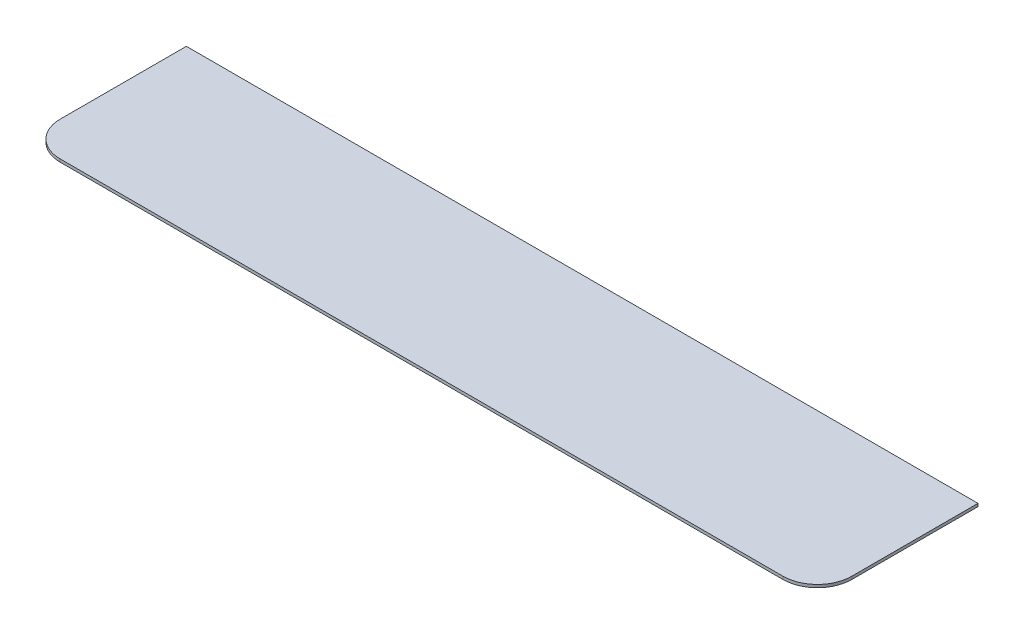
ISO-10303-21;
HEADER;
FILE_DESCRIPTION(('STEP AP214'),'2;1');
FILE_NAME('part.step','',(''),(''),'','','');
FILE_SCHEMA(('AUTOMOTIVE_DESIGN { 1 0 10303 214 1 1 1 1 }'));
ENDSEC;
DATA;
#1=APPLICATION_CONTEXT('core data for automotive mechanical design processes');
#2=APPLICATION_PROTOCOL_DEFINITION('international standard','automotive_design',2000,#1);
#3=PRODUCT_CONTEXT('',#1,'mechanical');
#4=PRODUCT('Part','Part','',(#3));
#5=PRODUCT_RELATED_PRODUCT_CATEGORY('part','',(#4));
#6=PRODUCT_DEFINITION_FORMATION('','',#4);
#7=PRODUCT_DEFINITION_CONTEXT('part definition',#1,'design');
#8=PRODUCT_DEFINITION('design','',#6,#7);
#9=PRODUCT_DEFINITION_SHAPE('','',#8);
#10=(LENGTH_UNIT() NAMED_UNIT(*) SI_UNIT(.MILLI.,.METRE.));
#11=(NAMED_UNIT(*) PLANE_ANGLE_UNIT() SI_UNIT($,.RADIAN.));
#12=(NAMED_UNIT(*) SI_UNIT($,.STERADIAN.) SOLID_ANGLE_UNIT());
#13=UNCERTAINTY_MEASURE_WITH_UNIT(LENGTH_MEASURE(1.E-05),#10,'distance_accuracy_value','');
#14=(GEOMETRIC_REPRESENTATION_CONTEXT(3) GLOBAL_UNCERTAINTY_ASSIGNED_CONTEXT((#13)) GLOBAL_UNIT_ASSIGNED_CONTEXT((#10,
#11,#12)) REPRESENTATION_CONTEXT('',''));
#15=CARTESIAN_POINT('',(0.,0.,0.));
#16=DIRECTION('',(0.,0.,1.));
#17=DIRECTION('',(1.,0.,0.));
#18=AXIS2_PLACEMENT_3D('',#15,#16,#17);
#19=CARTESIAN_POINT('',(0.,6.35,0.));
#20=DIRECTION('',(0.,1.,0.));
#21=DIRECTION('',(0.,0.,1.));
#22=AXIS2_PLACEMENT_3D('',#19,#20,#21);
#23=PLANE('',#22);
#24=DIRECTION('',(0.,0.,1.));
#25=VECTOR('',#24,1.);
#26=CARTESIAN_POINT('',(-1003.3,6.35,-177.8));
#27=LINE('',#26,#25);
#28=CARTESIAN_POINT('',(-1003.3,6.35,101.6));
#29=VERTEX_POINT('',#28);
#30=CARTESIAN_POINT('',(-1003.3,6.35,-177.8));
#31=VERTEX_POINT('',#30);
#32=EDGE_CURVE('E79',#29,#31,#27,.F.);
#33=ORIENTED_EDGE('',*,*,#32,.F.);
#34=CARTESIAN_POINT('',(-927.1,6.34999999999999,101.6));
#35=DIRECTION('',(0.,-1.,0.));
#36=DIRECTION('',(0.,0.,-1.));
#37=AXIS2_PLACEMENT_3D('',#34,#35,#36);
#38=CIRCLE('',#37,76.2);
#39=CARTESIAN_POINT('',(-927.1,6.35,177.8));
#40=VERTEX_POINT('',#39);
#41=EDGE_CURVE('E19',#40,#29,#38,.T.);
#42=ORIENTED_EDGE('',*,*,#41,.F.);
#43=DIRECTION('',(1.,0.,0.));
#44=VECTOR('',#43,1.);
#45=CARTESIAN_POINT('',(-1003.3,6.35,177.8));
#46=LINE('',#45,#44);
#47=CARTESIAN_POINT('',(673.1,6.35,177.8));
#48=VERTEX_POINT('',#47);
#49=EDGE_CURVE('E65',#48,#40,#46,.F.);
#50=ORIENTED_EDGE('',*,*,#49,.F.);
#51=CARTESIAN_POINT('',(673.1,6.34999999999999,101.6));
#52=DIRECTION('',(0.,-1.,0.));
#53=DIRECTION('',(0.,0.,-1.));
#54=AXIS2_PLACEMENT_3D('',#51,#52,#53);
#55=CIRCLE('',#54,76.2);
#56=CARTESIAN_POINT('',(749.3,6.35,101.6));
#57=VERTEX_POINT('',#56);
#58=EDGE_CURVE('E86',#57,#48,#55,.T.);
#59=ORIENTED_EDGE('',*,*,#58,.F.);
#60=DIRECTION('',(0.,0.,-1.));
#61=VECTOR('',#60,1.);
#62=CARTESIAN_POINT('',(749.3,6.35,177.8));
#63=LINE('',#62,#61);
#64=CARTESIAN_POINT('',(749.3,6.35,-177.8));
#65=VERTEX_POINT('',#64);
#66=EDGE_CURVE('E100',#65,#57,#63,.F.);
#67=ORIENTED_EDGE('',*,*,#66,.F.);
#68=DIRECTION('',(-1.,0.,0.));
#69=VECTOR('',#68,1.);
#70=CARTESIAN_POINT('',(749.3,6.35,-177.8));
#71=LINE('',#70,#69);
#72=EDGE_CURVE('E95',#31,#65,#71,.F.);
#73=ORIENTED_EDGE('',*,*,#72,.F.);
#74=EDGE_LOOP('',(#33,#42,#50,#59,#67,#73));
#75=FACE_BOUND('',#74,.T.);
#76=ADVANCED_FACE('F16',(#75),#23,.T.);
#77=CARTESIAN_POINT('',(-927.1,98.6155,101.6));
#78=DIRECTION('',(0.,-1.,0.));
#79=DIRECTION('',(0.,0.,-1.));
#80=AXIS2_PLACEMENT_3D('',#77,#78,#79);
#81=CYLINDRICAL_SURFACE('',#80,76.2);
#82=DIRECTION('',(0.,1.,0.));
#83=VECTOR('',#82,1.);
#84=CARTESIAN_POINT('',(-1003.3,0.,101.6));
#85=LINE('',#84,#83);
#86=CARTESIAN_POINT('',(-1003.3,0.,101.6));
#87=VERTEX_POINT('',#86);
#88=EDGE_CURVE('E109',#87,#29,#85,.T.);
#89=ORIENTED_EDGE('',*,*,#88,.F.);
#90=CARTESIAN_POINT('',(-927.1,0.,101.6));
#91=DIRECTION('',(0.,-1.,0.));
#92=DIRECTION('',(0.,0.,-1.));
#93=AXIS2_PLACEMENT_3D('',#90,#91,#92);
#94=CIRCLE('',#93,76.2);
#95=CARTESIAN_POINT('',(-927.1,0.,177.8));
#96=VERTEX_POINT('',#95);
#97=EDGE_CURVE('E85',#87,#96,#94,.F.);
#98=ORIENTED_EDGE('',*,*,#97,.T.);
#99=DIRECTION('',(0.,1.,0.));
#100=VECTOR('',#99,1.);
#101=CARTESIAN_POINT('',(-927.1,0.,177.8));
#102=LINE('',#101,#100);
#103=EDGE_CURVE('E70',#40,#96,#102,.F.);
#104=ORIENTED_EDGE('',*,*,#103,.F.);
#105=ORIENTED_EDGE('',*,*,#41,.T.);
#106=EDGE_LOOP('',(#89,#98,#104,#105));
#107=FACE_BOUND('',#106,.T.);
#108=ADVANCED_FACE('F84',(#107),#81,.T.);
#109=CARTESIAN_POINT('',(-1003.3,0.,177.8));
#110=DIRECTION('',(0.,0.,1.));
#111=DIRECTION('',(1.,0.,0.));
#112=AXIS2_PLACEMENT_3D('',#109,#110,#111);
#113=PLANE('',#112);
#114=ORIENTED_EDGE('',*,*,#49,.T.);
#115=ORIENTED_EDGE('',*,*,#103,.T.);
#116=DIRECTION('',(1.,0.,0.));
#117=VECTOR('',#116,1.);
#118=CARTESIAN_POINT('',(0.,0.,177.8));
#119=LINE('',#118,#117);
#120=CARTESIAN_POINT('',(673.1,0.,177.8));
#121=VERTEX_POINT('',#120);
#122=EDGE_CURVE('E108',#96,#121,#119,.T.);
#123=ORIENTED_EDGE('',*,*,#122,.T.);
#124=DIRECTION('',(0.,-1.,0.));
#125=VECTOR('',#124,1.);
#126=CARTESIAN_POINT('',(673.1,98.6155,177.8));
#127=LINE('',#126,#125);
#128=EDGE_CURVE('E72',#48,#121,#127,.T.);
#129=ORIENTED_EDGE('',*,*,#128,.F.);
#130=EDGE_LOOP('',(#114,#115,#123,#129));
#131=FACE_BOUND('',#130,.T.);
#132=ADVANCED_FACE('F67',(#131),#113,.T.);
#133=CARTESIAN_POINT('',(673.1,98.6155,101.6));
#134=DIRECTION('',(0.,-1.,0.));
#135=DIRECTION('',(0.,0.,-1.));
#136=AXIS2_PLACEMENT_3D('',#133,#134,#135);
#137=CYLINDRICAL_SURFACE('',#136,76.2);
#138=ORIENTED_EDGE('',*,*,#128,.T.);
#139=CARTESIAN_POINT('',(673.1,0.,101.6));
#140=DIRECTION('',(0.,-1.,0.));
#141=DIRECTION('',(0.,0.,-1.));
#142=AXIS2_PLACEMENT_3D('',#139,#140,#141);
#143=CIRCLE('',#142,76.2);
#144=CARTESIAN_POINT('',(749.3,0.,101.6));
#145=VERTEX_POINT('',#144);
#146=EDGE_CURVE('E104',#121,#145,#143,.F.);
#147=ORIENTED_EDGE('',*,*,#146,.T.);
#148=DIRECTION('',(0.,1.,0.));
#149=VECTOR('',#148,1.);
#150=CARTESIAN_POINT('',(749.3,0.,101.6));
#151=LINE('',#150,#149);
#152=EDGE_CURVE('E97',#57,#145,#151,.F.);
#153=ORIENTED_EDGE('',*,*,#152,.F.);
#154=ORIENTED_EDGE('',*,*,#58,.T.);
#155=EDGE_LOOP('',(#138,#147,#153,#154));
#156=FACE_BOUND('',#155,.T.);
#157=ADVANCED_FACE('F136',(#156),#137,.T.);
#158=CARTESIAN_POINT('',(749.3,0.,177.8));
#159=DIRECTION('',(1.,0.,0.));
#160=DIRECTION('',(0.,0.,-1.));
#161=AXIS2_PLACEMENT_3D('',#158,#159,#160);
#162=PLANE('',#161);
#163=ORIENTED_EDGE('',*,*,#66,.T.);
#164=ORIENTED_EDGE('',*,*,#152,.T.);
#165=DIRECTION('',(0.,0.,1.));
#166=VECTOR('',#165,1.);
#167=CARTESIAN_POINT('',(749.3,0.,0.));
#168=LINE('',#167,#166);
#169=CARTESIAN_POINT('',(749.3,0.,-177.8));
#170=VERTEX_POINT('',#169);
#171=EDGE_CURVE('E107',#145,#170,#168,.F.);
#172=ORIENTED_EDGE('',*,*,#171,.T.);
#173=DIRECTION('',(0.,1.,0.));
#174=VECTOR('',#173,1.);
#175=CARTESIAN_POINT('',(749.3,0.,-177.8));
#176=LINE('',#175,#174);
#177=EDGE_CURVE('E92',#65,#170,#176,.F.);
#178=ORIENTED_EDGE('',*,*,#177,.F.);
#179=EDGE_LOOP('',(#163,#164,#172,#178));
#180=FACE_BOUND('',#179,.T.);
#181=ADVANCED_FACE('F127',(#180),#162,.T.);
#182=CARTESIAN_POINT('',(749.3,0.,-177.8));
#183=DIRECTION('',(0.,0.,-1.));
#184=DIRECTION('',(-1.,0.,0.));
#185=AXIS2_PLACEMENT_3D('',#182,#183,#184);
#186=PLANE('',#185);
#187=ORIENTED_EDGE('',*,*,#177,.T.);
#188=DIRECTION('',(1.,0.,0.));
#189=VECTOR('',#188,1.);
#190=CARTESIAN_POINT('',(0.,0.,-177.8));
#191=LINE('',#190,#189);
#192=CARTESIAN_POINT('',(-1003.3,0.,-177.8));
#193=VERTEX_POINT('',#192);
#194=EDGE_CURVE('E25',#170,#193,#191,.F.);
#195=ORIENTED_EDGE('',*,*,#194,.T.);
#196=DIRECTION('',(0.,1.,0.));
#197=VECTOR('',#196,1.);
#198=CARTESIAN_POINT('',(-1003.3,0.,-177.8));
#199=LINE('',#198,#197);
#200=EDGE_CURVE('E33',#31,#193,#199,.F.);
#201=ORIENTED_EDGE('',*,*,#200,.F.);
#202=ORIENTED_EDGE('',*,*,#72,.T.);
#203=EDGE_LOOP('',(#187,#195,#201,#202));
#204=FACE_BOUND('',#203,.T.);
#205=ADVANCED_FACE('F138',(#204),#186,.T.);
#206=CARTESIAN_POINT('',(-1003.3,0.,-177.8));
#207=DIRECTION('',(-1.,0.,0.));
#208=DIRECTION('',(0.,0.,1.));
#209=AXIS2_PLACEMENT_3D('',#206,#207,#208);
#210=PLANE('',#209);
#211=DIRECTION('',(0.,0.,1.));
#212=VECTOR('',#211,1.);
#213=CARTESIAN_POINT('',(-1003.3,0.,0.));
#214=LINE('',#213,#212);
#215=EDGE_CURVE('E11',#193,#87,#214,.T.);
#216=ORIENTED_EDGE('',*,*,#215,.T.);
#217=ORIENTED_EDGE('',*,*,#88,.T.);
#218=ORIENTED_EDGE('',*,*,#32,.T.);
#219=ORIENTED_EDGE('',*,*,#200,.T.);
#220=EDGE_LOOP('',(#216,#217,#218,#219));
#221=FACE_BOUND('',#220,.T.);
#222=ADVANCED_FACE('F140',(#221),#210,.T.);
#223=CARTESIAN_POINT('',(0.,0.,0.));
#224=DIRECTION('',(0.,1.,0.));
#225=DIRECTION('',(0.,0.,1.));
#226=AXIS2_PLACEMENT_3D('',#223,#224,#225);
#227=PLANE('',#226);
#228=ORIENTED_EDGE('',*,*,#194,.F.);
#229=ORIENTED_EDGE('',*,*,#171,.F.);
#230=ORIENTED_EDGE('',*,*,#146,.F.);
#231=ORIENTED_EDGE('',*,*,#122,.F.);
#232=ORIENTED_EDGE('',*,*,#97,.F.);
#233=ORIENTED_EDGE('',*,*,#215,.F.);
#234=EDGE_LOOP('',(#228,#229,#230,#231,#232,#233));
#235=FACE_BOUND('',#234,.T.);
#236=ADVANCED_FACE('F134',(#235),#227,.F.);
#237=CLOSED_SHELL('',(#76,#108,#132,#157,#181,#205,#222,#236));
#238=MANIFOLD_SOLID_BREP('B1',#237);
#239=ADVANCED_BREP_SHAPE_REPRESENTATION('',(#18,#238),#14);
#240=SHAPE_DEFINITION_REPRESENTATION(#9,#239);
ENDSEC;
END-ISO-10303-21;
